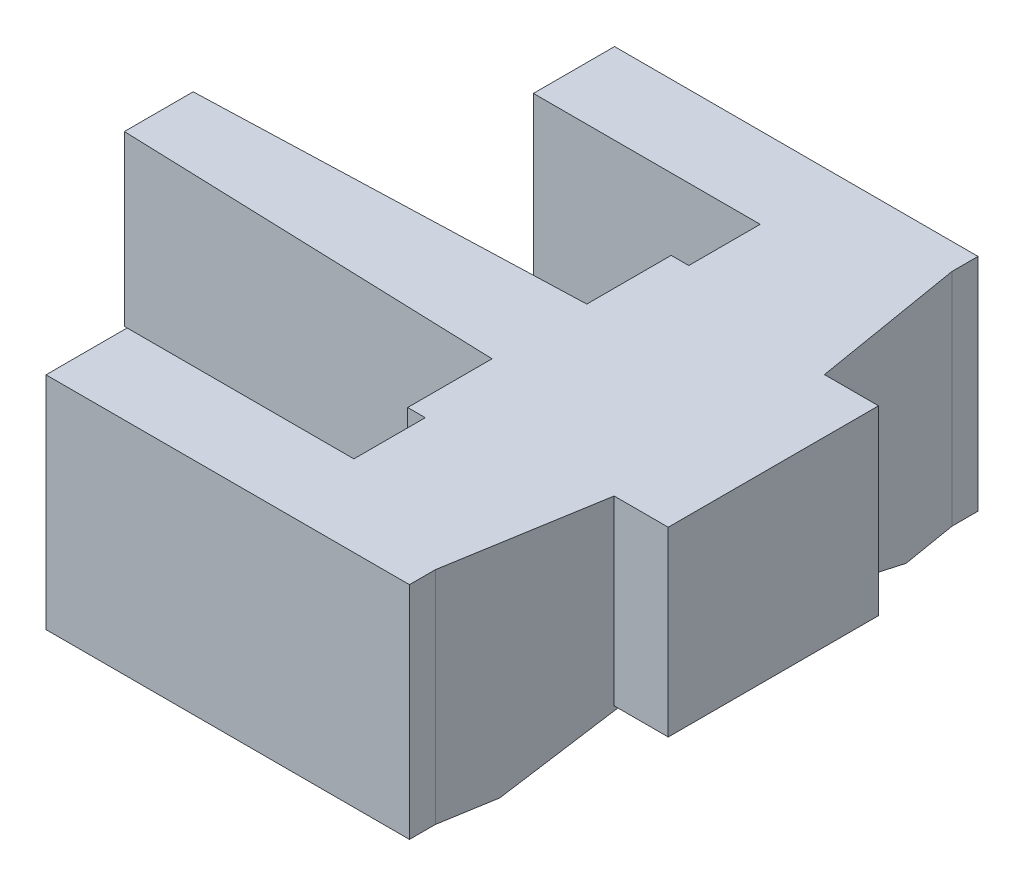
ISO-10303-21;
HEADER;
FILE_DESCRIPTION(('STEP AP214'),'2;1');
FILE_NAME('part.step','',(''),(''),'','','');
FILE_SCHEMA(('AUTOMOTIVE_DESIGN { 1 0 10303 214 1 1 1 1 }'));
ENDSEC;
DATA;
#1=APPLICATION_CONTEXT('core data for automotive mechanical design processes');
#2=APPLICATION_PROTOCOL_DEFINITION('international standard','automotive_design',2000,#1);
#3=PRODUCT_CONTEXT('',#1,'mechanical');
#4=PRODUCT('Part','Part','',(#3));
#5=PRODUCT_RELATED_PRODUCT_CATEGORY('part','',(#4));
#6=PRODUCT_DEFINITION_FORMATION('','',#4);
#7=PRODUCT_DEFINITION_CONTEXT('part definition',#1,'design');
#8=PRODUCT_DEFINITION('design','',#6,#7);
#9=PRODUCT_DEFINITION_SHAPE('','',#8);
#10=(LENGTH_UNIT() NAMED_UNIT(*) SI_UNIT(.MILLI.,.METRE.));
#11=(NAMED_UNIT(*) PLANE_ANGLE_UNIT() SI_UNIT($,.RADIAN.));
#12=(NAMED_UNIT(*) SI_UNIT($,.STERADIAN.) SOLID_ANGLE_UNIT());
#13=UNCERTAINTY_MEASURE_WITH_UNIT(LENGTH_MEASURE(1.E-05),#10,'distance_accuracy_value','');
#14=(GEOMETRIC_REPRESENTATION_CONTEXT(3) GLOBAL_UNCERTAINTY_ASSIGNED_CONTEXT((#13)) GLOBAL_UNIT_ASSIGNED_CONTEXT((#10,
#11,#12)) REPRESENTATION_CONTEXT('',''));
#15=CARTESIAN_POINT('',(0.,0.,0.));
#16=DIRECTION('',(0.,0.,1.));
#17=DIRECTION('',(1.,0.,0.));
#18=AXIS2_PLACEMENT_3D('',#15,#16,#17);
#19=CARTESIAN_POINT('',(42.7011333168489,17.,-80.8129094407043));
#20=DIRECTION('',(1.,0.,0.));
#21=DIRECTION('',(0.,0.,-1.));
#22=AXIS2_PLACEMENT_3D('',#19,#20,#21);
#23=PLANE('',#22);
#24=DIRECTION('',(0.,0.,1.));
#25=VECTOR('',#24,1.);
#26=CARTESIAN_POINT('',(42.7011333168489,3.,-81.8129094407043));
#27=LINE('',#26,#25);
#28=CARTESIAN_POINT('',(42.7011333168489,3.,-83.8129094407043));
#29=VERTEX_POINT('',#28);
#30=CARTESIAN_POINT('',(42.7011333168488,3.,-80.8129094407043));
#31=VERTEX_POINT('',#30);
#32=EDGE_CURVE('E48',#29,#31,#27,.T.);
#33=ORIENTED_EDGE('',*,*,#32,.F.);
#34=DIRECTION('',(0.,-1.,0.));
#35=VECTOR('',#34,1.);
#36=CARTESIAN_POINT('',(42.7011333168489,3.,-83.8129094407043));
#37=LINE('',#36,#35);
#38=CARTESIAN_POINT('',(42.7011333168489,17.,-83.8129094407043));
#39=VERTEX_POINT('',#38);
#40=EDGE_CURVE('E53',#39,#29,#37,.T.);
#41=ORIENTED_EDGE('',*,*,#40,.F.);
#42=DIRECTION('',(0.,0.,1.));
#43=VECTOR('',#42,1.);
#44=CARTESIAN_POINT('',(42.7011333168489,17.,-80.8129094407043));
#45=LINE('',#44,#43);
#46=CARTESIAN_POINT('',(42.7011333168488,17.,-89.3129094407043));
#47=VERTEX_POINT('',#46);
#48=EDGE_CURVE('E368',#47,#39,#45,.T.);
#49=ORIENTED_EDGE('',*,*,#48,.F.);
#50=DIRECTION('',(0.,-1.,0.));
#51=VECTOR('',#50,1.);
#52=CARTESIAN_POINT('',(42.7011333168488,17.,-89.3129094407043));
#53=LINE('',#52,#51);
#54=CARTESIAN_POINT('',(42.7011333168488,0.,-89.3129094407043));
#55=VERTEX_POINT('',#54);
#56=EDGE_CURVE('E41',#47,#55,#53,.T.);
#57=ORIENTED_EDGE('',*,*,#56,.T.);
#58=DIRECTION('',(0.,-0.332820117735138,-0.942990333582889));
#59=VECTOR('',#58,1.);
#60=CARTESIAN_POINT('',(42.7011333168488,3.,-80.8129094407043));
#61=LINE('',#60,#59);
#62=EDGE_CURVE('E345',#31,#55,#61,.T.);
#63=ORIENTED_EDGE('',*,*,#62,.F.);
#64=EDGE_LOOP('',(#33,#41,#49,#57,#63));
#65=FACE_BOUND('',#64,.T.);
#66=ADVANCED_FACE('F33',(#65),#23,.F.);
#67=CARTESIAN_POINT('',(42.7011333168488,17.,-58.0129094407043));
#68=DIRECTION('',(1.,0.,0.));
#69=DIRECTION('',(0.,0.,-1.));
#70=AXIS2_PLACEMENT_3D('',#67,#68,#69);
#71=PLANE('',#70);
#72=DIRECTION('',(0.,1.,0.));
#73=VECTOR('',#72,1.);
#74=CARTESIAN_POINT('',(42.7011333168488,17.,-63.5129094407039));
#75=LINE('',#74,#73);
#76=CARTESIAN_POINT('',(42.7011333168488,3.,-63.5129094407039));
#77=VERTEX_POINT('',#76);
#78=CARTESIAN_POINT('',(42.7011333168488,17.,-63.5129094407039));
#79=VERTEX_POINT('',#78);
#80=EDGE_CURVE('E236',#77,#79,#75,.T.);
#81=ORIENTED_EDGE('',*,*,#80,.F.);
#82=DIRECTION('',(0.,0.,-1.));
#83=VECTOR('',#82,1.);
#84=CARTESIAN_POINT('',(42.7011333168488,3.,-65.5129094407039));
#85=LINE('',#84,#83);
#86=CARTESIAN_POINT('',(42.7011333168488,3.,-66.5129094407039));
#87=VERTEX_POINT('',#86);
#88=EDGE_CURVE('E278',#77,#87,#85,.T.);
#89=ORIENTED_EDGE('',*,*,#88,.T.);
#90=DIRECTION('',(0.,0.332820117735152,-0.942990333582884));
#91=VECTOR('',#90,1.);
#92=CARTESIAN_POINT('',(42.7011333168488,3.,-66.5129094407039));
#93=LINE('',#92,#91);
#94=CARTESIAN_POINT('',(42.7011333168488,0.,-58.0129094407043));
#95=VERTEX_POINT('',#94);
#96=EDGE_CURVE('E334',#95,#87,#93,.T.);
#97=ORIENTED_EDGE('',*,*,#96,.F.);
#98=DIRECTION('',(0.,-1.,0.));
#99=VECTOR('',#98,1.);
#100=CARTESIAN_POINT('',(42.7011333168488,17.,-58.0129094407043));
#101=LINE('',#100,#99);
#102=CARTESIAN_POINT('',(42.7011333168488,17.,-58.0129094407043));
#103=VERTEX_POINT('',#102);
#104=EDGE_CURVE('E412',#103,#95,#101,.T.);
#105=ORIENTED_EDGE('',*,*,#104,.F.);
#106=DIRECTION('',(0.,0.,1.));
#107=VECTOR('',#106,1.);
#108=CARTESIAN_POINT('',(42.7011333168488,17.,-58.0129094407043));
#109=LINE('',#108,#107);
#110=EDGE_CURVE('E379',#79,#103,#109,.T.);
#111=ORIENTED_EDGE('',*,*,#110,.F.);
#112=EDGE_LOOP('',(#81,#89,#97,#105,#111));
#113=FACE_BOUND('',#112,.T.);
#114=ADVANCED_FACE('F482',(#113),#71,.F.);
#115=CARTESIAN_POINT('',(53.2314449051028,17.,-93.5629094407043));
#116=DIRECTION('',(-0.98634535633291,0.,0.164690127331617));
#117=DIRECTION('',(0.164690127331617,0.,0.98634535633291));
#118=AXIS2_PLACEMENT_3D('',#115,#116,#117);
#119=PLANE('',#118);
#120=DIRECTION('',(-0.164690127331617,0.,-0.98634535633291));
#121=VECTOR('',#120,1.);
#122=CARTESIAN_POINT('',(53.2314449051028,3.,-93.5629094407043));
#123=LINE('',#122,#121);
#124=CARTESIAN_POINT('',(55.3603129633302,3.,-80.8129094407043));
#125=VERTEX_POINT('',#124);
#126=CARTESIAN_POINT('',(55.2016914217368,3.,-81.7629094407043));
#127=VERTEX_POINT('',#126);
#128=EDGE_CURVE('E260',#125,#127,#123,.T.);
#129=ORIENTED_EDGE('',*,*,#128,.F.);
#130=DIRECTION('',(-0.155535016690426,-0.328769823194058,-0.931514499049831));
#131=VECTOR('',#130,1.);
#132=CARTESIAN_POINT('',(54.177446473952,0.499657537896461,-87.897213083331));
#133=LINE('',#132,#131);
#134=CARTESIAN_POINT('',(53.9410675911786,0.,-89.3129094407043));
#135=VERTEX_POINT('',#134);
#136=EDGE_CURVE('E350',#125,#135,#133,.T.);
#137=ORIENTED_EDGE('',*,*,#136,.T.);
#138=DIRECTION('',(-0.164690127331617,0.,-0.98634535633291));
#139=VECTOR('',#138,1.);
#140=CARTESIAN_POINT('',(53.2314449051028,0.,-93.5629094407043));
#141=LINE('',#140,#139);
#142=CARTESIAN_POINT('',(53.2314449051028,0.,-93.5629094407043));
#143=VERTEX_POINT('',#142);
#144=EDGE_CURVE('E366',#135,#143,#141,.T.);
#145=ORIENTED_EDGE('',*,*,#144,.T.);
#146=DIRECTION('',(0.,-1.,0.));
#147=VECTOR('',#146,1.);
#148=CARTESIAN_POINT('',(53.2314449051028,17.,-93.5629094407043));
#149=LINE('',#148,#147);
#150=CARTESIAN_POINT('',(53.2314449051028,17.,-93.5629094407043));
#151=VERTEX_POINT('',#150);
#152=EDGE_CURVE('E392',#151,#143,#149,.T.);
#153=ORIENTED_EDGE('',*,*,#152,.F.);
#154=DIRECTION('',(-0.164690127331617,0.,-0.98634535633291));
#155=VECTOR('',#154,1.);
#156=CARTESIAN_POINT('',(53.2314449051028,17.,-93.5629094407043));
#157=LINE('',#156,#155);
#158=CARTESIAN_POINT('',(55.2016914217368,17.,-81.7629094407043));
#159=VERTEX_POINT('',#158);
#160=EDGE_CURVE('E390',#159,#151,#157,.T.);
#161=ORIENTED_EDGE('',*,*,#160,.F.);
#162=DIRECTION('',(0.,1.,0.));
#163=VECTOR('',#162,1.);
#164=CARTESIAN_POINT('',(55.2016914217368,17.,-81.7629094407043));
#165=LINE('',#164,#163);
#166=EDGE_CURVE('E262',#127,#159,#165,.T.);
#167=ORIENTED_EDGE('',*,*,#166,.F.);
#168=EDGE_LOOP('',(#129,#137,#145,#153,#161,#167));
#169=FACE_BOUND('',#168,.T.);
#170=ADVANCED_FACE('F440',(#169),#119,.F.);
#171=CARTESIAN_POINT('',(55.3686614655194,17.,-66.5629094407043));
#172=DIRECTION('',(-0.98634535633291,0.,-0.164690127331617));
#173=DIRECTION('',(-0.164690127331617,0.,0.98634535633291));
#174=AXIS2_PLACEMENT_3D('',#171,#172,#173);
#175=PLANE('',#174);
#176=DIRECTION('',(0.164690127331617,0.,-0.98634535633291));
#177=VECTOR('',#176,1.);
#178=CARTESIAN_POINT('',(55.3686614655194,3.,-66.5629094407043));
#179=LINE('',#178,#177);
#180=CARTESIAN_POINT('',(55.2016914217368,3.,-65.5629094407041));
#181=VERTEX_POINT('',#180);
#182=CARTESIAN_POINT('',(55.3603129633302,3.,-66.5129094407039));
#183=VERTEX_POINT('',#182);
#184=EDGE_CURVE('E272',#181,#183,#179,.T.);
#185=ORIENTED_EDGE('',*,*,#184,.F.);
#186=DIRECTION('',(0.,1.,0.));
#187=VECTOR('',#186,1.);
#188=CARTESIAN_POINT('',(55.2016914217368,17.,-65.5629094407041));
#189=LINE('',#188,#187);
#190=CARTESIAN_POINT('',(55.2016914217368,17.,-65.5629094407041));
#191=VERTEX_POINT('',#190);
#192=EDGE_CURVE('E274',#181,#191,#189,.T.);
#193=ORIENTED_EDGE('',*,*,#192,.T.);
#194=DIRECTION('',(0.164690127331617,0.,-0.98634535633291));
#195=VECTOR('',#194,1.);
#196=CARTESIAN_POINT('',(55.3686614655194,17.,-66.5629094407043));
#197=LINE('',#196,#195);
#198=CARTESIAN_POINT('',(53.2314449051028,17.,-53.7629094407043));
#199=VERTEX_POINT('',#198);
#200=EDGE_CURVE('E385',#199,#191,#197,.T.);
#201=ORIENTED_EDGE('',*,*,#200,.F.);
#202=DIRECTION('',(0.,-1.,0.));
#203=VECTOR('',#202,1.);
#204=CARTESIAN_POINT('',(53.2314449051028,17.,-53.7629094407043));
#205=LINE('',#204,#203);
#206=CARTESIAN_POINT('',(53.2314449051028,0.,-53.7629094407043));
#207=VERTEX_POINT('',#206);
#208=EDGE_CURVE('E407',#199,#207,#205,.T.);
#209=ORIENTED_EDGE('',*,*,#208,.T.);
#210=DIRECTION('',(0.164690127331617,0.,-0.98634535633291));
#211=VECTOR('',#210,1.);
#212=CARTESIAN_POINT('',(55.3686614655194,0.,-66.5629094407043));
#213=LINE('',#212,#211);
#214=CARTESIAN_POINT('',(53.9410675911786,0.,-58.0129094407043));
#215=VERTEX_POINT('',#214);
#216=EDGE_CURVE('E401',#207,#215,#213,.T.);
#217=ORIENTED_EDGE('',*,*,#216,.T.);
#218=DIRECTION('',(0.155535016690426,0.328769823194072,-0.931514499049826));
#219=VECTOR('',#218,1.);
#220=CARTESIAN_POINT('',(56.0836521584143,4.52899394835635,-70.8450589610467));
#221=LINE('',#220,#219);
#222=EDGE_CURVE('E341',#215,#183,#221,.T.);
#223=ORIENTED_EDGE('',*,*,#222,.T.);
#224=EDGE_LOOP('',(#185,#193,#201,#209,#217,#223));
#225=FACE_BOUND('',#224,.T.);
#226=ADVANCED_FACE('F458',(#225),#175,.F.);
#227=CARTESIAN_POINT('',(12.0186614655194,17.,-76.3129094407043));
#228=DIRECTION('',(0.0340792834650468,0.,0.999419132515738));
#229=DIRECTION('',(0.999419132515737,0.,-0.0340792834650468));
#230=AXIS2_PLACEMENT_3D('',#227,#228,#229);
#231=PLANE('',#230);
#232=DIRECTION('',(0.999419132515737,0.,-0.0340792834650468));
#233=VECTOR('',#232,1.);
#234=CARTESIAN_POINT('',(41.3449568244222,4.,-77.3129094407043));
#235=LINE('',#234,#233);
#236=CARTESIAN_POINT('',(12.0186614655194,4.,-76.3129094407043));
#237=VERTEX_POINT('',#236);
#238=CARTESIAN_POINT('',(41.3449568244222,4.,-77.3129094407043));
#239=VERTEX_POINT('',#238);
#240=EDGE_CURVE('E315',#237,#239,#235,.T.);
#241=ORIENTED_EDGE('',*,*,#240,.F.);
#242=DIRECTION('',(0.,-1.,0.));
#243=VECTOR('',#242,1.);
#244=CARTESIAN_POINT('',(12.0186614655194,17.,-76.3129094407043));
#245=LINE('',#244,#243);
#246=CARTESIAN_POINT('',(12.0186614655194,17.,-76.3129094407043));
#247=VERTEX_POINT('',#246);
#248=EDGE_CURVE('E421',#247,#237,#245,.T.);
#249=ORIENTED_EDGE('',*,*,#248,.F.);
#250=DIRECTION('',(-0.999419132515737,0.,0.0340792834650468));
#251=VECTOR('',#250,1.);
#252=CARTESIAN_POINT('',(12.0186614655194,17.,-76.3129094407043));
#253=LINE('',#252,#251);
#254=CARTESIAN_POINT('',(41.3449568244222,17.,-77.3129094407043));
#255=VERTEX_POINT('',#254);
#256=EDGE_CURVE('E371',#255,#247,#253,.T.);
#257=ORIENTED_EDGE('',*,*,#256,.F.);
#258=DIRECTION('',(0.,-1.,0.));
#259=VECTOR('',#258,1.);
#260=CARTESIAN_POINT('',(41.3449568244222,17.,-77.3129094407043));
#261=LINE('',#260,#259);
#262=EDGE_CURVE('E424',#255,#239,#261,.T.);
#263=ORIENTED_EDGE('',*,*,#262,.T.);
#264=EDGE_LOOP('',(#241,#249,#257,#263));
#265=FACE_BOUND('',#264,.T.);
#266=ADVANCED_FACE('F505',(#265),#231,.F.);
#267=CARTESIAN_POINT('',(12.0186614655193,17.,-71.0129094407043));
#268=DIRECTION('',(1.,0.,0.));
#269=DIRECTION('',(0.,0.,-1.));
#270=AXIS2_PLACEMENT_3D('',#267,#268,#269);
#271=PLANE('',#270);
#272=DIRECTION('',(0.,0.,-1.));
#273=VECTOR('',#272,1.);
#274=CARTESIAN_POINT('',(12.0186614655194,4.,-76.3129094407043));
#275=LINE('',#274,#273);
#276=CARTESIAN_POINT('',(12.0186614655193,4.,-71.0129094407043));
#277=VERTEX_POINT('',#276);
#278=EDGE_CURVE('E328',#277,#237,#275,.T.);
#279=ORIENTED_EDGE('',*,*,#278,.F.);
#280=DIRECTION('',(0.,-1.,0.));
#281=VECTOR('',#280,1.);
#282=CARTESIAN_POINT('',(12.0186614655193,17.,-71.0129094407043));
#283=LINE('',#282,#281);
#284=CARTESIAN_POINT('',(12.0186614655193,17.,-71.0129094407043));
#285=VERTEX_POINT('',#284);
#286=EDGE_CURVE('E418',#285,#277,#283,.T.);
#287=ORIENTED_EDGE('',*,*,#286,.F.);
#288=DIRECTION('',(0.,0.,1.));
#289=VECTOR('',#288,1.);
#290=CARTESIAN_POINT('',(12.0186614655193,17.,-71.0129094407043));
#291=LINE('',#290,#289);
#292=EDGE_CURVE('E373',#247,#285,#291,.T.);
#293=ORIENTED_EDGE('',*,*,#292,.F.);
#294=ORIENTED_EDGE('',*,*,#248,.T.);
#295=EDGE_LOOP('',(#279,#287,#293,#294));
#296=FACE_BOUND('',#295,.T.);
#297=ADVANCED_FACE('F661',(#296),#271,.F.);
#298=CARTESIAN_POINT('',(41.3449568244222,17.,-70.0129094407043));
#299=DIRECTION('',(0.0340792834650473,0.,-0.999419132515738));
#300=DIRECTION('',(-0.999419132515737,0.,-0.0340792834650473));
#301=AXIS2_PLACEMENT_3D('',#298,#299,#300);
#302=PLANE('',#301);
#303=DIRECTION('',(-0.999419132515737,0.,-0.0340792834650473));
#304=VECTOR('',#303,1.);
#305=CARTESIAN_POINT('',(12.0186614655193,4.,-71.0129094407043));
#306=LINE('',#305,#304);
#307=CARTESIAN_POINT('',(41.3449568244222,4.,-70.0129094407043));
#308=VERTEX_POINT('',#307);
#309=EDGE_CURVE('E326',#308,#277,#306,.T.);
#310=ORIENTED_EDGE('',*,*,#309,.F.);
#311=DIRECTION('',(0.,-1.,0.));
#312=VECTOR('',#311,1.);
#313=CARTESIAN_POINT('',(41.3449568244222,17.,-70.0129094407043));
#314=LINE('',#313,#312);
#315=CARTESIAN_POINT('',(41.3449568244222,17.,-70.0129094407043));
#316=VERTEX_POINT('',#315);
#317=EDGE_CURVE('E415',#316,#308,#314,.T.);
#318=ORIENTED_EDGE('',*,*,#317,.F.);
#319=DIRECTION('',(0.999419132515737,0.,0.0340792834650473));
#320=VECTOR('',#319,1.);
#321=CARTESIAN_POINT('',(41.3449568244222,17.,-70.0129094407043));
#322=LINE('',#321,#320);
#323=EDGE_CURVE('E375',#285,#316,#322,.T.);
#324=ORIENTED_EDGE('',*,*,#323,.F.);
#325=ORIENTED_EDGE('',*,*,#286,.T.);
#326=EDGE_LOOP('',(#310,#318,#324,#325));
#327=FACE_BOUND('',#326,.T.);
#328=ADVANCED_FACE('F668',(#327),#302,.F.);
#329=CARTESIAN_POINT('',(41.3449568244222,17.,-77.3129094407043));
#330=DIRECTION('',(1.,0.,0.));
#331=DIRECTION('',(0.,0.,-1.));
#332=AXIS2_PLACEMENT_3D('',#329,#330,#331);
#333=PLANE('',#332);
#334=DIRECTION('',(0.,0.,-1.));
#335=VECTOR('',#334,1.);
#336=CARTESIAN_POINT('',(41.3449568244222,3.,-77.3129094407043));
#337=LINE('',#336,#335);
#338=CARTESIAN_POINT('',(41.3449568244222,3.,-75.763096413664));
#339=VERTEX_POINT('',#338);
#340=CARTESIAN_POINT('',(41.3449568244222,3.,-83.8129094407043));
#341=VERTEX_POINT('',#340);
#342=EDGE_CURVE('E212',#339,#341,#337,.T.);
#343=ORIENTED_EDGE('',*,*,#342,.F.);
#344=DIRECTION('',(0.,-1.,0.));
#345=VECTOR('',#344,1.);
#346=CARTESIAN_POINT('',(41.3449568244222,4.,-75.763096413664));
#347=LINE('',#346,#345);
#348=CARTESIAN_POINT('',(41.3449568244222,4.,-75.763096413664));
#349=VERTEX_POINT('',#348);
#350=EDGE_CURVE('E330',#349,#339,#347,.T.);
#351=ORIENTED_EDGE('',*,*,#350,.F.);
#352=DIRECTION('',(0.,0.,1.));
#353=VECTOR('',#352,1.);
#354=CARTESIAN_POINT('',(41.3449568244222,4.,-77.3129094407043));
#355=LINE('',#354,#353);
#356=EDGE_CURVE('E318',#239,#349,#355,.T.);
#357=ORIENTED_EDGE('',*,*,#356,.F.);
#358=ORIENTED_EDGE('',*,*,#262,.F.);
#359=DIRECTION('',(0.,0.,1.));
#360=VECTOR('',#359,1.);
#361=CARTESIAN_POINT('',(41.3449568244222,17.,-77.3129094407043));
#362=LINE('',#361,#360);
#363=CARTESIAN_POINT('',(41.3449568244222,17.,-83.8129094407043));
#364=VERTEX_POINT('',#363);
#365=EDGE_CURVE('E233',#364,#255,#362,.T.);
#366=ORIENTED_EDGE('',*,*,#365,.F.);
#367=DIRECTION('',(0.,1.,0.));
#368=VECTOR('',#367,1.);
#369=CARTESIAN_POINT('',(41.3449568244222,3.,-83.8129094407043));
#370=LINE('',#369,#368);
#371=EDGE_CURVE('E228',#341,#364,#370,.T.);
#372=ORIENTED_EDGE('',*,*,#371,.F.);
#373=EDGE_LOOP('',(#343,#351,#357,#358,#366,#372));
#374=FACE_BOUND('',#373,.T.);
#375=ADVANCED_FACE('F231',(#374),#333,.F.);
#376=CARTESIAN_POINT('',(41.3449568244222,17.,-66.5129094407043));
#377=DIRECTION('',(1.,0.,0.));
#378=DIRECTION('',(0.,0.,-1.));
#379=AXIS2_PLACEMENT_3D('',#376,#377,#378);
#380=PLANE('',#379);
#381=DIRECTION('',(0.,0.,-1.));
#382=VECTOR('',#381,1.);
#383=CARTESIAN_POINT('',(41.3449568244222,3.,-66.5129094407043));
#384=LINE('',#383,#382);
#385=CARTESIAN_POINT('',(41.3449568244222,3.,-63.5129094407039));
#386=VERTEX_POINT('',#385);
#387=CARTESIAN_POINT('',(41.3449568244222,3.,-71.5627224677447));
#388=VERTEX_POINT('',#387);
#389=EDGE_CURVE('E357',#386,#388,#384,.T.);
#390=ORIENTED_EDGE('',*,*,#389,.F.);
#391=DIRECTION('',(0.,-1.,0.));
#392=VECTOR('',#391,1.);
#393=CARTESIAN_POINT('',(41.3449568244222,17.,-63.5129094407039));
#394=LINE('',#393,#392);
#395=CARTESIAN_POINT('',(41.3449568244222,17.,-63.5129094407039));
#396=VERTEX_POINT('',#395);
#397=EDGE_CURVE('E245',#396,#386,#394,.T.);
#398=ORIENTED_EDGE('',*,*,#397,.F.);
#399=DIRECTION('',(0.,0.,1.));
#400=VECTOR('',#399,1.);
#401=CARTESIAN_POINT('',(41.3449568244222,17.,-66.5129094407043));
#402=LINE('',#401,#400);
#403=EDGE_CURVE('E377',#316,#396,#402,.T.);
#404=ORIENTED_EDGE('',*,*,#403,.F.);
#405=ORIENTED_EDGE('',*,*,#317,.T.);
#406=DIRECTION('',(0.,0.,1.));
#407=VECTOR('',#406,1.);
#408=CARTESIAN_POINT('',(41.3449568244222,4.,-70.0129094407043));
#409=LINE('',#408,#407);
#410=CARTESIAN_POINT('',(41.3449568244222,4.,-71.5627224677447));
#411=VERTEX_POINT('',#410);
#412=EDGE_CURVE('E324',#411,#308,#409,.T.);
#413=ORIENTED_EDGE('',*,*,#412,.F.);
#414=DIRECTION('',(0.,-1.,0.));
#415=VECTOR('',#414,1.);
#416=CARTESIAN_POINT('',(41.3449568244222,4.,-71.5627224677447));
#417=LINE('',#416,#415);
#418=EDGE_CURVE('E331',#411,#388,#417,.T.);
#419=ORIENTED_EDGE('',*,*,#418,.T.);
#420=EDGE_LOOP('',(#390,#398,#404,#405,#413,#419));
#421=FACE_BOUND('',#420,.T.);
#422=ADVANCED_FACE('F494',(#421),#380,.F.);
#423=CARTESIAN_POINT('',(59.3686614655194,17.,-80.7629094407043));
#424=DIRECTION('',(-1.,0.,0.));
#425=DIRECTION('',(0.,0.,1.));
#426=AXIS2_PLACEMENT_3D('',#423,#424,#425);
#427=PLANE('',#426);
#428=DIRECTION('',(0.,0.,1.));
#429=VECTOR('',#428,1.);
#430=CARTESIAN_POINT('',(59.3686614655194,3.,-80.7629094407043));
#431=LINE('',#430,#429);
#432=CARTESIAN_POINT('',(59.3686614655194,3.,-81.7629094407043));
#433=VERTEX_POINT('',#432);
#434=CARTESIAN_POINT('',(59.3686614655194,3.,-65.5629094407041));
#435=VERTEX_POINT('',#434);
#436=EDGE_CURVE('E355',#433,#435,#431,.T.);
#437=ORIENTED_EDGE('',*,*,#436,.F.);
#438=DIRECTION('',(0.,-1.,0.));
#439=VECTOR('',#438,1.);
#440=CARTESIAN_POINT('',(59.3686614655194,3.,-81.7629094407043));
#441=LINE('',#440,#439);
#442=CARTESIAN_POINT('',(59.3686614655194,17.,-81.7629094407043));
#443=VERTEX_POINT('',#442);
#444=EDGE_CURVE('E251',#443,#433,#441,.T.);
#445=ORIENTED_EDGE('',*,*,#444,.F.);
#446=DIRECTION('',(0.,0.,-1.));
#447=VECTOR('',#446,1.);
#448=CARTESIAN_POINT('',(59.3686614655194,17.,-80.7629094407043));
#449=LINE('',#448,#447);
#450=CARTESIAN_POINT('',(59.3686614655194,17.,-65.5629094407041));
#451=VERTEX_POINT('',#450);
#452=EDGE_CURVE('E388',#451,#443,#449,.T.);
#453=ORIENTED_EDGE('',*,*,#452,.F.);
#454=DIRECTION('',(0.,1.,0.));
#455=VECTOR('',#454,1.);
#456=CARTESIAN_POINT('',(59.3686614655194,3.,-65.5629094407041));
#457=LINE('',#456,#455);
#458=EDGE_CURVE('E264',#435,#451,#457,.T.);
#459=ORIENTED_EDGE('',*,*,#458,.F.);
#460=EDGE_LOOP('',(#437,#445,#453,#459));
#461=FACE_BOUND('',#460,.T.);
#462=ADVANCED_FACE('F450',(#461),#427,.F.);
#463=CARTESIAN_POINT('',(0.,0.,0.));
#464=DIRECTION('',(0.,-1.,0.));
#465=DIRECTION('',(0.,0.,-1.));
#466=AXIS2_PLACEMENT_3D('',#463,#464,#465);
#467=PLANE('',#466);
#468=DIRECTION('',(-1.,0.,0.));
#469=VECTOR('',#468,1.);
#470=CARTESIAN_POINT('',(62.7011333168488,0.,-58.0129094407043));
#471=LINE('',#470,#469);
#472=EDGE_CURVE('E338',#215,#95,#471,.T.);
#473=ORIENTED_EDGE('',*,*,#472,.F.);
#474=ORIENTED_EDGE('',*,*,#216,.F.);
#475=DIRECTION('',(0.,0.,-1.));
#476=VECTOR('',#475,1.);
#477=CARTESIAN_POINT('',(53.2314449051028,0.,-51.7629094407043));
#478=LINE('',#477,#476);
#479=CARTESIAN_POINT('',(53.2314449051028,0.,-51.7629094407043));
#480=VERTEX_POINT('',#479);
#481=EDGE_CURVE('E292',#480,#207,#478,.T.);
#482=ORIENTED_EDGE('',*,*,#481,.F.);
#483=DIRECTION('',(1.,0.,0.));
#484=VECTOR('',#483,1.);
#485=CARTESIAN_POINT('',(53.2314449051028,0.,-51.7629094407043));
#486=LINE('',#485,#484);
#487=CARTESIAN_POINT('',(25.2314449051028,0.,-51.7629094407043));
#488=VERTEX_POINT('',#487);
#489=EDGE_CURVE('E290',#488,#480,#486,.T.);
#490=ORIENTED_EDGE('',*,*,#489,.F.);
#491=DIRECTION('',(0.,0.,1.));
#492=VECTOR('',#491,1.);
#493=CARTESIAN_POINT('',(25.2314449051028,0.,-53.7629094407043));
#494=LINE('',#493,#492);
#495=CARTESIAN_POINT('',(25.2314449051028,0.,-58.0129094407043));
#496=VERTEX_POINT('',#495);
#497=EDGE_CURVE('E399',#496,#488,#494,.T.);
#498=ORIENTED_EDGE('',*,*,#497,.F.);
#499=DIRECTION('',(-1.,0.,0.));
#500=VECTOR('',#499,1.);
#501=CARTESIAN_POINT('',(25.2314449051028,0.,-58.0129094407043));
#502=LINE('',#501,#500);
#503=EDGE_CURVE('E397',#95,#496,#502,.T.);
#504=ORIENTED_EDGE('',*,*,#503,.F.);
#505=EDGE_LOOP('',(#473,#474,#482,#490,#498,#504));
#506=FACE_BOUND('',#505,.T.);
#507=ADVANCED_FACE('F471',(#506),#467,.T.);
#508=CARTESIAN_POINT('',(25.2314449051028,17.,-89.3129094407043));
#509=DIRECTION('',(1.,0.,0.));
#510=DIRECTION('',(0.,0.,-1.));
#511=AXIS2_PLACEMENT_3D('',#508,#509,#510);
#512=PLANE('',#511);
#513=DIRECTION('',(0.,0.,1.));
#514=VECTOR('',#513,1.);
#515=CARTESIAN_POINT('',(25.2314449051028,0.,-89.3129094407043));
#516=LINE('',#515,#514);
#517=CARTESIAN_POINT('',(25.2314449051028,0.,-95.5629094407043));
#518=VERTEX_POINT('',#517);
#519=CARTESIAN_POINT('',(25.2314449051028,0.,-89.3129094407043));
#520=VERTEX_POINT('',#519);
#521=EDGE_CURVE('E362',#518,#520,#516,.T.);
#522=ORIENTED_EDGE('',*,*,#521,.T.);
#523=DIRECTION('',(0.,-1.,0.));
#524=VECTOR('',#523,1.);
#525=CARTESIAN_POINT('',(25.2314449051028,17.,-89.3129094407043));
#526=LINE('',#525,#524);
#527=CARTESIAN_POINT('',(25.2314449051028,17.,-89.3129094407043));
#528=VERTEX_POINT('',#527);
#529=EDGE_CURVE('E11',#528,#520,#526,.T.);
#530=ORIENTED_EDGE('',*,*,#529,.F.);
#531=DIRECTION('',(0.,0.,1.));
#532=VECTOR('',#531,1.);
#533=CARTESIAN_POINT('',(25.2314449051028,17.,-89.3129094407043));
#534=LINE('',#533,#532);
#535=CARTESIAN_POINT('',(25.2314449051028,17.,-95.5629094407043));
#536=VERTEX_POINT('',#535);
#537=EDGE_CURVE('E363',#536,#528,#534,.T.);
#538=ORIENTED_EDGE('',*,*,#537,.F.);
#539=DIRECTION('',(0.,1.,0.));
#540=VECTOR('',#539,1.);
#541=CARTESIAN_POINT('',(25.2314449051028,0.,-95.5629094407043));
#542=LINE('',#541,#540);
#543=EDGE_CURVE('E304',#518,#536,#542,.T.);
#544=ORIENTED_EDGE('',*,*,#543,.F.);
#545=EDGE_LOOP('',(#522,#530,#538,#544));
#546=FACE_BOUND('',#545,.T.);
#547=ADVANCED_FACE('F35',(#546),#512,.F.);
#548=CARTESIAN_POINT('',(42.7011333168488,17.,-89.3129094407043));
#549=DIRECTION('',(0.,0.,-1.));
#550=DIRECTION('',(-1.,0.,0.));
#551=AXIS2_PLACEMENT_3D('',#548,#549,#550);
#552=PLANE('',#551);
#553=DIRECTION('',(1.,0.,0.));
#554=VECTOR('',#553,1.);
#555=CARTESIAN_POINT('',(42.7011333168488,0.,-89.3129094407043));
#556=LINE('',#555,#554);
#557=EDGE_CURVE('E394',#520,#55,#556,.T.);
#558=ORIENTED_EDGE('',*,*,#557,.T.);
#559=ORIENTED_EDGE('',*,*,#56,.F.);
#560=DIRECTION('',(1.,0.,0.));
#561=VECTOR('',#560,1.);
#562=CARTESIAN_POINT('',(42.7011333168488,17.,-89.3129094407043));
#563=LINE('',#562,#561);
#564=EDGE_CURVE('E365',#528,#47,#563,.T.);
#565=ORIENTED_EDGE('',*,*,#564,.F.);
#566=ORIENTED_EDGE('',*,*,#529,.T.);
#567=EDGE_LOOP('',(#558,#559,#565,#566));
#568=FACE_BOUND('',#567,.T.);
#569=ADVANCED_FACE('F430',(#568),#552,.F.);
#570=CARTESIAN_POINT('',(25.2314449051028,17.,-58.0129094407043));
#571=DIRECTION('',(0.,0.,1.));
#572=DIRECTION('',(1.,0.,0.));
#573=AXIS2_PLACEMENT_3D('',#570,#571,#572);
#574=PLANE('',#573);
#575=ORIENTED_EDGE('',*,*,#503,.T.);
#576=DIRECTION('',(0.,-1.,0.));
#577=VECTOR('',#576,1.);
#578=CARTESIAN_POINT('',(25.2314449051028,17.,-58.0129094407043));
#579=LINE('',#578,#577);
#580=CARTESIAN_POINT('',(25.2314449051028,17.,-58.0129094407043));
#581=VERTEX_POINT('',#580);
#582=EDGE_CURVE('E409',#581,#496,#579,.T.);
#583=ORIENTED_EDGE('',*,*,#582,.F.);
#584=DIRECTION('',(-1.,0.,0.));
#585=VECTOR('',#584,1.);
#586=CARTESIAN_POINT('',(25.2314449051028,17.,-58.0129094407043));
#587=LINE('',#586,#585);
#588=EDGE_CURVE('E381',#103,#581,#587,.T.);
#589=ORIENTED_EDGE('',*,*,#588,.F.);
#590=ORIENTED_EDGE('',*,*,#104,.T.);
#591=EDGE_LOOP('',(#575,#583,#589,#590));
#592=FACE_BOUND('',#591,.T.);
#593=ADVANCED_FACE('F485',(#592),#574,.F.);
#594=CARTESIAN_POINT('',(25.2314449051028,17.,-53.7629094407043));
#595=DIRECTION('',(1.,0.,0.));
#596=DIRECTION('',(0.,0.,-1.));
#597=AXIS2_PLACEMENT_3D('',#594,#595,#596);
#598=PLANE('',#597);
#599=ORIENTED_EDGE('',*,*,#497,.T.);
#600=DIRECTION('',(0.,-1.,0.));
#601=VECTOR('',#600,1.);
#602=CARTESIAN_POINT('',(25.2314449051028,17.,-51.7629094407043));
#603=LINE('',#602,#601);
#604=CARTESIAN_POINT('',(25.2314449051028,17.,-51.7629094407043));
#605=VERTEX_POINT('',#604);
#606=EDGE_CURVE('E287',#605,#488,#603,.T.);
#607=ORIENTED_EDGE('',*,*,#606,.F.);
#608=DIRECTION('',(0.,0.,1.));
#609=VECTOR('',#608,1.);
#610=CARTESIAN_POINT('',(25.2314449051028,17.,-53.7629094407043));
#611=LINE('',#610,#609);
#612=EDGE_CURVE('E383',#581,#605,#611,.T.);
#613=ORIENTED_EDGE('',*,*,#612,.F.);
#614=ORIENTED_EDGE('',*,*,#582,.T.);
#615=EDGE_LOOP('',(#599,#607,#613,#614));
#616=FACE_BOUND('',#615,.T.);
#617=ADVANCED_FACE('F539',(#616),#598,.F.);
#618=CARTESIAN_POINT('',(0.,17.,0.));
#619=DIRECTION('',(0.,-1.,0.));
#620=DIRECTION('',(0.,0.,-1.));
#621=AXIS2_PLACEMENT_3D('',#618,#619,#620);
#622=PLANE('',#621);
#623=DIRECTION('',(-1.,0.,0.));
#624=VECTOR('',#623,1.);
#625=CARTESIAN_POINT('',(42.7011333168488,17.,-63.5129094407039));
#626=LINE('',#625,#624);
#627=EDGE_CURVE('E242',#79,#396,#626,.T.);
#628=ORIENTED_EDGE('',*,*,#627,.F.);
#629=ORIENTED_EDGE('',*,*,#110,.T.);
#630=ORIENTED_EDGE('',*,*,#588,.T.);
#631=ORIENTED_EDGE('',*,*,#612,.T.);
#632=DIRECTION('',(-1.,0.,0.));
#633=VECTOR('',#632,1.);
#634=CARTESIAN_POINT('',(53.2314449051028,17.,-51.7629094407043));
#635=LINE('',#634,#633);
#636=CARTESIAN_POINT('',(53.2314449051028,17.,-51.7629094407043));
#637=VERTEX_POINT('',#636);
#638=EDGE_CURVE('E284',#637,#605,#635,.T.);
#639=ORIENTED_EDGE('',*,*,#638,.F.);
#640=DIRECTION('',(0.,0.,-1.));
#641=VECTOR('',#640,1.);
#642=CARTESIAN_POINT('',(53.2314449051028,17.,-51.7629094407043));
#643=LINE('',#642,#641);
#644=EDGE_CURVE('E295',#637,#199,#643,.T.);
#645=ORIENTED_EDGE('',*,*,#644,.T.);
#646=ORIENTED_EDGE('',*,*,#200,.T.);
#647=DIRECTION('',(-1.,0.,0.));
#648=VECTOR('',#647,1.);
#649=CARTESIAN_POINT('',(59.3686614655194,17.,-65.5629094407041));
#650=LINE('',#649,#648);
#651=EDGE_CURVE('E267',#451,#191,#650,.T.);
#652=ORIENTED_EDGE('',*,*,#651,.F.);
#653=ORIENTED_EDGE('',*,*,#452,.T.);
#654=DIRECTION('',(1.,0.,0.));
#655=VECTOR('',#654,1.);
#656=CARTESIAN_POINT('',(55.3686614655194,17.,-81.7629094407043));
#657=LINE('',#656,#655);
#658=EDGE_CURVE('E257',#159,#443,#657,.T.);
#659=ORIENTED_EDGE('',*,*,#658,.F.);
#660=ORIENTED_EDGE('',*,*,#160,.T.);
#661=DIRECTION('',(0.,0.,1.));
#662=VECTOR('',#661,1.);
#663=CARTESIAN_POINT('',(53.2314449051028,17.,-95.5629094407043));
#664=LINE('',#663,#662);
#665=CARTESIAN_POINT('',(53.2314449051028,17.,-95.5629094407043));
#666=VERTEX_POINT('',#665);
#667=EDGE_CURVE('E309',#666,#151,#664,.T.);
#668=ORIENTED_EDGE('',*,*,#667,.F.);
#669=DIRECTION('',(1.,0.,0.));
#670=VECTOR('',#669,1.);
#671=CARTESIAN_POINT('',(53.2314449051028,17.,-95.5629094407043));
#672=LINE('',#671,#670);
#673=EDGE_CURVE('E307',#536,#666,#672,.T.);
#674=ORIENTED_EDGE('',*,*,#673,.F.);
#675=ORIENTED_EDGE('',*,*,#537,.T.);
#676=ORIENTED_EDGE('',*,*,#564,.T.);
#677=ORIENTED_EDGE('',*,*,#48,.T.);
#678=DIRECTION('',(1.,0.,0.));
#679=VECTOR('',#678,1.);
#680=CARTESIAN_POINT('',(42.7011333168489,17.,-83.8129094407043));
#681=LINE('',#680,#679);
#682=EDGE_CURVE('E234',#364,#39,#681,.T.);
#683=ORIENTED_EDGE('',*,*,#682,.F.);
#684=ORIENTED_EDGE('',*,*,#365,.T.);
#685=ORIENTED_EDGE('',*,*,#256,.T.);
#686=ORIENTED_EDGE('',*,*,#292,.T.);
#687=ORIENTED_EDGE('',*,*,#323,.T.);
#688=ORIENTED_EDGE('',*,*,#403,.T.);
#689=EDGE_LOOP('',(#628,#629,#630,#631,#639,#645,#646,#652,#653,#659,#660,#668,#674,#675,#676,
#677,#683,#684,#685,#686,#687,#688));
#690=FACE_BOUND('',#689,.T.);
#691=ADVANCED_FACE('F461',(#690),#622,.F.);
#692=DIRECTION('',(-1.,0.,0.));
#693=VECTOR('',#692,1.);
#694=CARTESIAN_POINT('',(62.7011333168488,0.,-89.3129094407043));
#695=LINE('',#694,#693);
#696=EDGE_CURVE('E347',#135,#55,#695,.T.);
#697=ORIENTED_EDGE('',*,*,#696,.T.);
#698=ORIENTED_EDGE('',*,*,#557,.F.);
#699=ORIENTED_EDGE('',*,*,#521,.F.);
#700=DIRECTION('',(-1.,0.,0.));
#701=VECTOR('',#700,1.);
#702=CARTESIAN_POINT('',(53.2314449051028,0.,-95.5629094407043));
#703=LINE('',#702,#701);
#704=CARTESIAN_POINT('',(53.2314449051028,0.,-95.5629094407043));
#705=VERTEX_POINT('',#704);
#706=EDGE_CURVE('E301',#705,#518,#703,.T.);
#707=ORIENTED_EDGE('',*,*,#706,.F.);
#708=DIRECTION('',(0.,0.,1.));
#709=VECTOR('',#708,1.);
#710=CARTESIAN_POINT('',(53.2314449051028,0.,-95.5629094407043));
#711=LINE('',#710,#709);
#712=EDGE_CURVE('E312',#705,#143,#711,.T.);
#713=ORIENTED_EDGE('',*,*,#712,.T.);
#714=ORIENTED_EDGE('',*,*,#144,.F.);
#715=EDGE_LOOP('',(#697,#698,#699,#707,#713,#714));
#716=FACE_BOUND('',#715,.T.);
#717=ADVANCED_FACE('F434',(#716),#467,.T.);
#718=CARTESIAN_POINT('',(42.7011333168489,-1.,-73.6629094407043));
#719=DIRECTION('',(0.,1.,0.));
#720=DIRECTION('',(0.,0.,1.));
#721=AXIS2_PLACEMENT_3D('',#718,#719,#720);
#722=CYLINDRICAL_SURFACE('',#721,2.5);
#723=CARTESIAN_POINT('',(42.7011333168489,-1.,-73.6629094407043));
#724=DIRECTION('',(0.,-1.,0.));
#725=DIRECTION('',(0.,0.,-1.));
#726=AXIS2_PLACEMENT_3D('',#723,#724,#725);
#727=CIRCLE('',#726,2.5);
#728=CARTESIAN_POINT('',(42.7011333168489,-1.,-76.1629094407043));
#729=VERTEX_POINT('',#728);
#730=EDGE_CURVE('E222',#729,#729,#727,.T.);
#731=ORIENTED_EDGE('',*,*,#730,.F.);
#732=EDGE_LOOP('',(#731));
#733=FACE_BOUND('',#732,.T.);
#734=CARTESIAN_POINT('',(42.7011333168489,3.,-73.6629094407043));
#735=DIRECTION('',(0.,1.,0.));
#736=DIRECTION('',(0.,0.,-1.));
#737=AXIS2_PLACEMENT_3D('',#734,#735,#736);
#738=CIRCLE('',#737,2.50000000000001);
#739=EDGE_CURVE('E218',#388,#339,#738,.T.);
#740=ORIENTED_EDGE('',*,*,#739,.F.);
#741=ORIENTED_EDGE('',*,*,#418,.F.);
#742=CARTESIAN_POINT('',(42.7011333168489,4.,-73.6629094407043));
#743=DIRECTION('',(0.,1.,0.));
#744=DIRECTION('',(0.,0.,-1.));
#745=AXIS2_PLACEMENT_3D('',#742,#743,#744);
#746=CIRCLE('',#745,2.50000000000001);
#747=EDGE_CURVE('E321',#349,#411,#746,.T.);
#748=ORIENTED_EDGE('',*,*,#747,.F.);
#749=ORIENTED_EDGE('',*,*,#350,.T.);
#750=EDGE_LOOP('',(#740,#741,#748,#749));
#751=FACE_BOUND('',#750,.T.);
#752=ADVANCED_FACE('F497',(#733,#751),#722,.T.);
#753=CARTESIAN_POINT('',(42.7011333168489,-1.,-73.6629094407043));
#754=DIRECTION('',(0.,-1.,0.));
#755=DIRECTION('',(0.,0.,-1.));
#756=AXIS2_PLACEMENT_3D('',#753,#754,#755);
#757=PLANE('',#756);
#758=ORIENTED_EDGE('',*,*,#730,.T.);
#759=EDGE_LOOP('',(#758));
#760=FACE_BOUND('',#759,.T.);
#761=ADVANCED_FACE('F556',(#760),#757,.T.);
#762=CARTESIAN_POINT('',(42.7011333168489,3.,-73.6629094407043));
#763=DIRECTION('',(0.,-1.,0.));
#764=DIRECTION('',(0.,0.,-1.));
#765=AXIS2_PLACEMENT_3D('',#762,#763,#764);
#766=PLANE('',#765);
#767=DIRECTION('',(-1.,0.,0.));
#768=VECTOR('',#767,1.);
#769=CARTESIAN_POINT('',(62.7011333168488,3.,-80.8129094407043));
#770=LINE('',#769,#768);
#771=EDGE_CURVE('E348',#125,#31,#770,.T.);
#772=ORIENTED_EDGE('',*,*,#771,.F.);
#773=ORIENTED_EDGE('',*,*,#128,.T.);
#774=DIRECTION('',(-1.,0.,0.));
#775=VECTOR('',#774,1.);
#776=CARTESIAN_POINT('',(59.3686614655194,3.,-81.7629094407043));
#777=LINE('',#776,#775);
#778=EDGE_CURVE('E254',#433,#127,#777,.T.);
#779=ORIENTED_EDGE('',*,*,#778,.F.);
#780=ORIENTED_EDGE('',*,*,#436,.T.);
#781=DIRECTION('',(1.,0.,0.));
#782=VECTOR('',#781,1.);
#783=CARTESIAN_POINT('',(55.3686614655194,3.,-65.5629094407041));
#784=LINE('',#783,#782);
#785=EDGE_CURVE('E269',#181,#435,#784,.T.);
#786=ORIENTED_EDGE('',*,*,#785,.F.);
#787=ORIENTED_EDGE('',*,*,#184,.T.);
#788=DIRECTION('',(-1.,0.,0.));
#789=VECTOR('',#788,1.);
#790=CARTESIAN_POINT('',(62.7011333168488,3.,-66.5129094407039));
#791=LINE('',#790,#789);
#792=EDGE_CURVE('E339',#183,#87,#791,.T.);
#793=ORIENTED_EDGE('',*,*,#792,.T.);
#794=ORIENTED_EDGE('',*,*,#88,.F.);
#795=DIRECTION('',(1.,0.,0.));
#796=VECTOR('',#795,1.);
#797=CARTESIAN_POINT('',(42.7011333168488,3.,-63.5129094407039));
#798=LINE('',#797,#796);
#799=EDGE_CURVE('E248',#386,#77,#798,.T.);
#800=ORIENTED_EDGE('',*,*,#799,.F.);
#801=ORIENTED_EDGE('',*,*,#389,.T.);
#802=ORIENTED_EDGE('',*,*,#739,.T.);
#803=ORIENTED_EDGE('',*,*,#342,.T.);
#804=DIRECTION('',(-1.,0.,0.));
#805=VECTOR('',#804,1.);
#806=CARTESIAN_POINT('',(42.7011333168489,3.,-83.8129094407043));
#807=LINE('',#806,#805);
#808=EDGE_CURVE('E216',#29,#341,#807,.T.);
#809=ORIENTED_EDGE('',*,*,#808,.F.);
#810=ORIENTED_EDGE('',*,*,#32,.T.);
#811=EDGE_LOOP('',(#772,#773,#779,#780,#786,#787,#793,#794,#800,#801,#802,#803,#809,#810));
#812=FACE_BOUND('',#811,.T.);
#813=ADVANCED_FACE('F215',(#812),#766,.T.);
#814=CARTESIAN_POINT('',(62.7011333168488,3.,-80.8129094407043));
#815=DIRECTION('',(0.,0.942990333582889,-0.332820117735138));
#816=DIRECTION('',(0.,0.332820117735138,0.942990333582889));
#817=AXIS2_PLACEMENT_3D('',#814,#815,#816);
#818=PLANE('',#817);
#819=ORIENTED_EDGE('',*,*,#771,.T.);
#820=ORIENTED_EDGE('',*,*,#62,.T.);
#821=ORIENTED_EDGE('',*,*,#696,.F.);
#822=ORIENTED_EDGE('',*,*,#136,.F.);
#823=EDGE_LOOP('',(#819,#820,#821,#822));
#824=FACE_BOUND('',#823,.T.);
#825=ADVANCED_FACE('F438',(#824),#818,.F.);
#826=CARTESIAN_POINT('',(62.7011333168488,3.,-66.5129094407039));
#827=DIRECTION('',(0.,0.942990333582884,0.332820117735152));
#828=DIRECTION('',(0.,-0.332820117735152,0.942990333582884));
#829=AXIS2_PLACEMENT_3D('',#826,#827,#828);
#830=PLANE('',#829);
#831=ORIENTED_EDGE('',*,*,#472,.T.);
#832=ORIENTED_EDGE('',*,*,#96,.T.);
#833=ORIENTED_EDGE('',*,*,#792,.F.);
#834=ORIENTED_EDGE('',*,*,#222,.F.);
#835=EDGE_LOOP('',(#831,#832,#833,#834));
#836=FACE_BOUND('',#835,.T.);
#837=ADVANCED_FACE('F477',(#836),#830,.F.);
#838=CARTESIAN_POINT('',(42.7011333168489,4.,-73.6629094407043));
#839=DIRECTION('',(0.,-1.,0.));
#840=DIRECTION('',(0.,0.,-1.));
#841=AXIS2_PLACEMENT_3D('',#838,#839,#840);
#842=PLANE('',#841);
#843=ORIENTED_EDGE('',*,*,#240,.T.);
#844=ORIENTED_EDGE('',*,*,#356,.T.);
#845=ORIENTED_EDGE('',*,*,#747,.T.);
#846=ORIENTED_EDGE('',*,*,#412,.T.);
#847=ORIENTED_EDGE('',*,*,#309,.T.);
#848=ORIENTED_EDGE('',*,*,#278,.T.);
#849=EDGE_LOOP('',(#843,#844,#845,#846,#847,#848));
#850=FACE_BOUND('',#849,.T.);
#851=ADVANCED_FACE('F501',(#850),#842,.T.);
#852=CARTESIAN_POINT('',(53.2314449051028,0.,-95.5629094407043));
#853=DIRECTION('',(-1.,0.,0.));
#854=DIRECTION('',(0.,0.,1.));
#855=AXIS2_PLACEMENT_3D('',#852,#853,#854);
#856=PLANE('',#855);
#857=ORIENTED_EDGE('',*,*,#152,.T.);
#858=ORIENTED_EDGE('',*,*,#712,.F.);
#859=DIRECTION('',(0.,-1.,0.));
#860=VECTOR('',#859,1.);
#861=CARTESIAN_POINT('',(53.2314449051028,0.,-95.5629094407043));
#862=LINE('',#861,#860);
#863=EDGE_CURVE('E298',#666,#705,#862,.T.);
#864=ORIENTED_EDGE('',*,*,#863,.F.);
#865=ORIENTED_EDGE('',*,*,#667,.T.);
#866=EDGE_LOOP('',(#857,#858,#864,#865));
#867=FACE_BOUND('',#866,.T.);
#868=ADVANCED_FACE('F517',(#867),#856,.F.);
#869=CARTESIAN_POINT('',(0.,0.,-95.5629094407043));
#870=DIRECTION('',(0.,0.,1.));
#871=DIRECTION('',(1.,0.,0.));
#872=AXIS2_PLACEMENT_3D('',#869,#870,#871);
#873=PLANE('',#872);
#874=ORIENTED_EDGE('',*,*,#863,.T.);
#875=ORIENTED_EDGE('',*,*,#706,.T.);
#876=ORIENTED_EDGE('',*,*,#543,.T.);
#877=ORIENTED_EDGE('',*,*,#673,.T.);
#878=EDGE_LOOP('',(#874,#875,#876,#877));
#879=FACE_BOUND('',#878,.T.);
#880=ADVANCED_FACE('F513',(#879),#873,.F.);
#881=CARTESIAN_POINT('',(53.2314449051028,17.,-51.7629094407043));
#882=DIRECTION('',(-1.,0.,0.));
#883=DIRECTION('',(0.,0.,1.));
#884=AXIS2_PLACEMENT_3D('',#881,#882,#883);
#885=PLANE('',#884);
#886=ORIENTED_EDGE('',*,*,#208,.F.);
#887=ORIENTED_EDGE('',*,*,#644,.F.);
#888=DIRECTION('',(0.,1.,0.));
#889=VECTOR('',#888,1.);
#890=CARTESIAN_POINT('',(53.2314449051028,17.,-51.7629094407043));
#891=LINE('',#890,#889);
#892=EDGE_CURVE('E281',#480,#637,#891,.T.);
#893=ORIENTED_EDGE('',*,*,#892,.F.);
#894=ORIENTED_EDGE('',*,*,#481,.T.);
#895=EDGE_LOOP('',(#886,#887,#893,#894));
#896=FACE_BOUND('',#895,.T.);
#897=ADVANCED_FACE('F466',(#896),#885,.F.);
#898=CARTESIAN_POINT('',(0.,0.,-51.7629094407043));
#899=DIRECTION('',(0.,0.,-1.));
#900=DIRECTION('',(-1.,0.,0.));
#901=AXIS2_PLACEMENT_3D('',#898,#899,#900);
#902=PLANE('',#901);
#903=ORIENTED_EDGE('',*,*,#892,.T.);
#904=ORIENTED_EDGE('',*,*,#638,.T.);
#905=ORIENTED_EDGE('',*,*,#606,.T.);
#906=ORIENTED_EDGE('',*,*,#489,.T.);
#907=EDGE_LOOP('',(#903,#904,#905,#906));
#908=FACE_BOUND('',#907,.T.);
#909=ADVANCED_FACE('F630',(#908),#902,.F.);
#910=CARTESIAN_POINT('',(0.,0.,-65.5629094407041));
#911=DIRECTION('',(0.,0.,1.));
#912=DIRECTION('',(1.,0.,0.));
#913=AXIS2_PLACEMENT_3D('',#910,#911,#912);
#914=PLANE('',#913);
#915=ORIENTED_EDGE('',*,*,#192,.F.);
#916=ORIENTED_EDGE('',*,*,#785,.T.);
#917=ORIENTED_EDGE('',*,*,#458,.T.);
#918=ORIENTED_EDGE('',*,*,#651,.T.);
#919=EDGE_LOOP('',(#915,#916,#917,#918));
#920=FACE_BOUND('',#919,.T.);
#921=ADVANCED_FACE('F456',(#920),#914,.T.);
#922=CARTESIAN_POINT('',(0.,0.,-81.7629094407043));
#923=DIRECTION('',(0.,0.,1.));
#924=DIRECTION('',(1.,0.,0.));
#925=AXIS2_PLACEMENT_3D('',#922,#923,#924);
#926=PLANE('',#925);
#927=ORIENTED_EDGE('',*,*,#778,.T.);
#928=ORIENTED_EDGE('',*,*,#166,.T.);
#929=ORIENTED_EDGE('',*,*,#658,.T.);
#930=ORIENTED_EDGE('',*,*,#444,.T.);
#931=EDGE_LOOP('',(#927,#928,#929,#930));
#932=FACE_BOUND('',#931,.T.);
#933=ADVANCED_FACE('F446',(#932),#926,.F.);
#934=CARTESIAN_POINT('',(0.,0.,-63.5129094407039));
#935=DIRECTION('',(0.,0.,-1.));
#936=DIRECTION('',(-1.,0.,0.));
#937=AXIS2_PLACEMENT_3D('',#934,#935,#936);
#938=PLANE('',#937);
#939=ORIENTED_EDGE('',*,*,#80,.T.);
#940=ORIENTED_EDGE('',*,*,#627,.T.);
#941=ORIENTED_EDGE('',*,*,#397,.T.);
#942=ORIENTED_EDGE('',*,*,#799,.T.);
#943=EDGE_LOOP('',(#939,#940,#941,#942));
#944=FACE_BOUND('',#943,.T.);
#945=ADVANCED_FACE('F490',(#944),#938,.F.);
#946=CARTESIAN_POINT('',(0.,0.,-83.8129094407043));
#947=DIRECTION('',(0.,0.,1.));
#948=DIRECTION('',(1.,0.,0.));
#949=AXIS2_PLACEMENT_3D('',#946,#947,#948);
#950=PLANE('',#949);
#951=ORIENTED_EDGE('',*,*,#40,.T.);
#952=ORIENTED_EDGE('',*,*,#808,.T.);
#953=ORIENTED_EDGE('',*,*,#371,.T.);
#954=ORIENTED_EDGE('',*,*,#682,.T.);
#955=EDGE_LOOP('',(#951,#952,#953,#954));
#956=FACE_BOUND('',#955,.T.);
#957=ADVANCED_FACE('F226',(#956),#950,.F.);
#958=CLOSED_SHELL('',(#66,#114,#170,#226,#266,#297,#328,#375,#422,#462,#507,#547,#569,#593,#617,
#691,#717,#752,#761,#813,#825,#837,#851,#868,#880,#897,#909,#921,#933,#945,#957));
#959=MANIFOLD_SOLID_BREP('B2',#958);
#960=ADVANCED_BREP_SHAPE_REPRESENTATION('',(#18,#959),#14);
#961=SHAPE_DEFINITION_REPRESENTATION(#9,#960);
ENDSEC;
END-ISO-10303-21;
